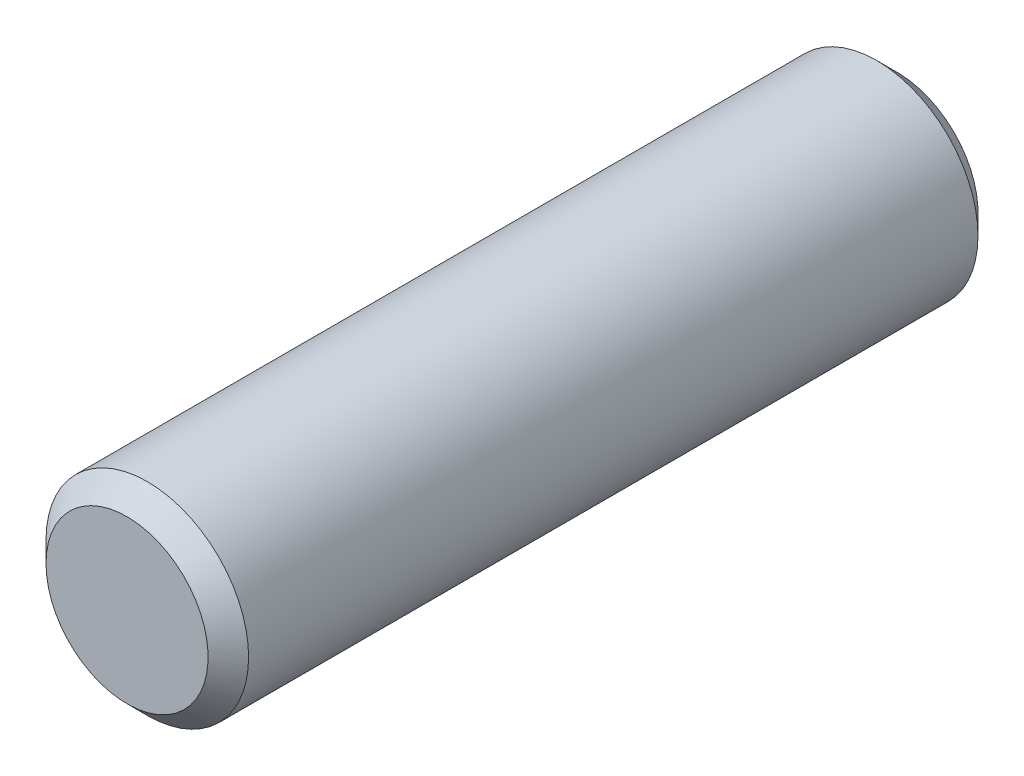
ISO-10303-21;
HEADER;
FILE_DESCRIPTION(('STEP AP214'),'2;1');
FILE_NAME('part.step','',(''),(''),'','','');
FILE_SCHEMA(('AUTOMOTIVE_DESIGN { 1 0 10303 214 1 1 1 1 }'));
ENDSEC;
DATA;
#1=APPLICATION_CONTEXT('core data for automotive mechanical design processes');
#2=APPLICATION_PROTOCOL_DEFINITION('international standard','automotive_design',2000,#1);
#3=PRODUCT_CONTEXT('',#1,'mechanical');
#4=PRODUCT('Part','Part','',(#3));
#5=PRODUCT_RELATED_PRODUCT_CATEGORY('part','',(#4));
#6=PRODUCT_DEFINITION_FORMATION('','',#4);
#7=PRODUCT_DEFINITION_CONTEXT('part definition',#1,'design');
#8=PRODUCT_DEFINITION('design','',#6,#7);
#9=PRODUCT_DEFINITION_SHAPE('','',#8);
#10=(LENGTH_UNIT() NAMED_UNIT(*) SI_UNIT(.MILLI.,.METRE.));
#11=(NAMED_UNIT(*) PLANE_ANGLE_UNIT() SI_UNIT($,.RADIAN.));
#12=(NAMED_UNIT(*) SI_UNIT($,.STERADIAN.) SOLID_ANGLE_UNIT());
#13=UNCERTAINTY_MEASURE_WITH_UNIT(LENGTH_MEASURE(1.E-05),#10,'distance_accuracy_value','');
#14=(GEOMETRIC_REPRESENTATION_CONTEXT(3) GLOBAL_UNCERTAINTY_ASSIGNED_CONTEXT((#13)) GLOBAL_UNIT_ASSIGNED_CONTEXT((#10,
#11,#12)) REPRESENTATION_CONTEXT('',''));
#15=CARTESIAN_POINT('',(0.,0.,0.));
#16=DIRECTION('',(0.,0.,1.));
#17=DIRECTION('',(1.,0.,0.));
#18=AXIS2_PLACEMENT_3D('',#15,#16,#17);
#19=CARTESIAN_POINT('',(0.,0.,-10.));
#20=DIRECTION('',(0.,0.,-1.));
#21=DIRECTION('',(0.,1.,0.));
#22=AXIS2_PLACEMENT_3D('',#19,#20,#21);
#23=CYLINDRICAL_SURFACE('',#22,1.);
#24=CARTESIAN_POINT('',(0.,0.,-8.6));
#25=DIRECTION('',(0.,0.,-1.));
#26=DIRECTION('',(-1.,0.,0.));
#27=AXIS2_PLACEMENT_3D('',#24,#25,#26);
#28=CIRCLE('',#27,1.);
#29=CARTESIAN_POINT('',(-1.,0.,-8.6));
#30=VERTEX_POINT('',#29);
#31=EDGE_CURVE('E37',#30,#30,#28,.T.);
#32=ORIENTED_EDGE('',*,*,#31,.F.);
#33=EDGE_LOOP('',(#32));
#34=FACE_BOUND('',#33,.T.);
#35=CARTESIAN_POINT('',(0.,0.,-1.4));
#36=DIRECTION('',(0.,0.,-1.));
#37=DIRECTION('',(-1.,0.,0.));
#38=AXIS2_PLACEMENT_3D('',#35,#36,#37);
#39=CIRCLE('',#38,1.);
#40=CARTESIAN_POINT('',(-1.,0.,-1.4));
#41=VERTEX_POINT('',#40);
#42=EDGE_CURVE('E10',#41,#41,#39,.T.);
#43=ORIENTED_EDGE('',*,*,#42,.T.);
#44=EDGE_LOOP('',(#43));
#45=FACE_BOUND('',#44,.T.);
#46=ADVANCED_FACE('F34',(#34,#45),#23,.T.);
#47=CARTESIAN_POINT('',(0.,0.,-8.8));
#48=DIRECTION('',(0.,0.,1.));
#49=DIRECTION('',(1.,0.,0.));
#50=AXIS2_PLACEMENT_3D('',#47,#48,#49);
#51=CONICAL_SURFACE('',#50,0.799999999999999,0.785398163397448);
#52=ORIENTED_EDGE('',*,*,#31,.T.);
#53=EDGE_LOOP('',(#52));
#54=FACE_BOUND('',#53,.T.);
#55=CARTESIAN_POINT('',(0.,0.,-8.8));
#56=DIRECTION('',(0.,0.,-1.));
#57=DIRECTION('',(-1.,0.,0.));
#58=AXIS2_PLACEMENT_3D('',#55,#56,#57);
#59=CIRCLE('',#58,0.799999999999999);
#60=CARTESIAN_POINT('',(-0.799999999999999,0.,-8.8));
#61=VERTEX_POINT('',#60);
#62=EDGE_CURVE('E47',#61,#61,#59,.T.);
#63=ORIENTED_EDGE('',*,*,#62,.F.);
#64=EDGE_LOOP('',(#63));
#65=FACE_BOUND('',#64,.T.);
#66=ADVANCED_FACE('F54',(#54,#65),#51,.T.);
#67=CARTESIAN_POINT('',(0.799999999999999,0.,-8.8));
#68=DIRECTION('',(0.,0.,-1.));
#69=DIRECTION('',(-1.,0.,0.));
#70=AXIS2_PLACEMENT_3D('',#67,#68,#69);
#71=PLANE('',#70);
#72=ORIENTED_EDGE('',*,*,#62,.T.);
#73=EDGE_LOOP('',(#72));
#74=FACE_BOUND('',#73,.T.);
#75=ADVANCED_FACE('F61',(#74),#71,.T.);
#76=CARTESIAN_POINT('',(0.,0.,-1.4));
#77=DIRECTION('',(0.,0.,-1.));
#78=DIRECTION('',(-1.,0.,0.));
#79=AXIS2_PLACEMENT_3D('',#76,#77,#78);
#80=CONICAL_SURFACE('',#79,1.,0.785398163397449);
#81=CARTESIAN_POINT('',(0.,0.,-1.2));
#82=DIRECTION('',(0.,0.,-1.));
#83=DIRECTION('',(-1.,0.,0.));
#84=AXIS2_PLACEMENT_3D('',#81,#82,#83);
#85=CIRCLE('',#84,0.799999999999999);
#86=CARTESIAN_POINT('',(-0.799999999999999,0.,-1.2));
#87=VERTEX_POINT('',#86);
#88=EDGE_CURVE('E41',#87,#87,#85,.T.);
#89=ORIENTED_EDGE('',*,*,#88,.T.);
#90=EDGE_LOOP('',(#89));
#91=FACE_BOUND('',#90,.T.);
#92=ORIENTED_EDGE('',*,*,#42,.F.);
#93=EDGE_LOOP('',(#92));
#94=FACE_BOUND('',#93,.T.);
#95=ADVANCED_FACE('F65',(#91,#94),#80,.T.);
#96=CARTESIAN_POINT('',(0.799999999999999,0.,-1.2));
#97=DIRECTION('',(0.,0.,1.));
#98=DIRECTION('',(1.,0.,0.));
#99=AXIS2_PLACEMENT_3D('',#96,#97,#98);
#100=PLANE('',#99);
#101=ORIENTED_EDGE('',*,*,#88,.F.);
#102=EDGE_LOOP('',(#101));
#103=FACE_BOUND('',#102,.T.);
#104=ADVANCED_FACE('F70',(#103),#100,.T.);
#105=CLOSED_SHELL('',(#46,#66,#75,#95,#104));
#106=MANIFOLD_SOLID_BREP('B2',#105);
#107=ADVANCED_BREP_SHAPE_REPRESENTATION('',(#18,#106),#14);
#108=SHAPE_DEFINITION_REPRESENTATION(#9,#107);
ENDSEC;
END-ISO-10303-21;
